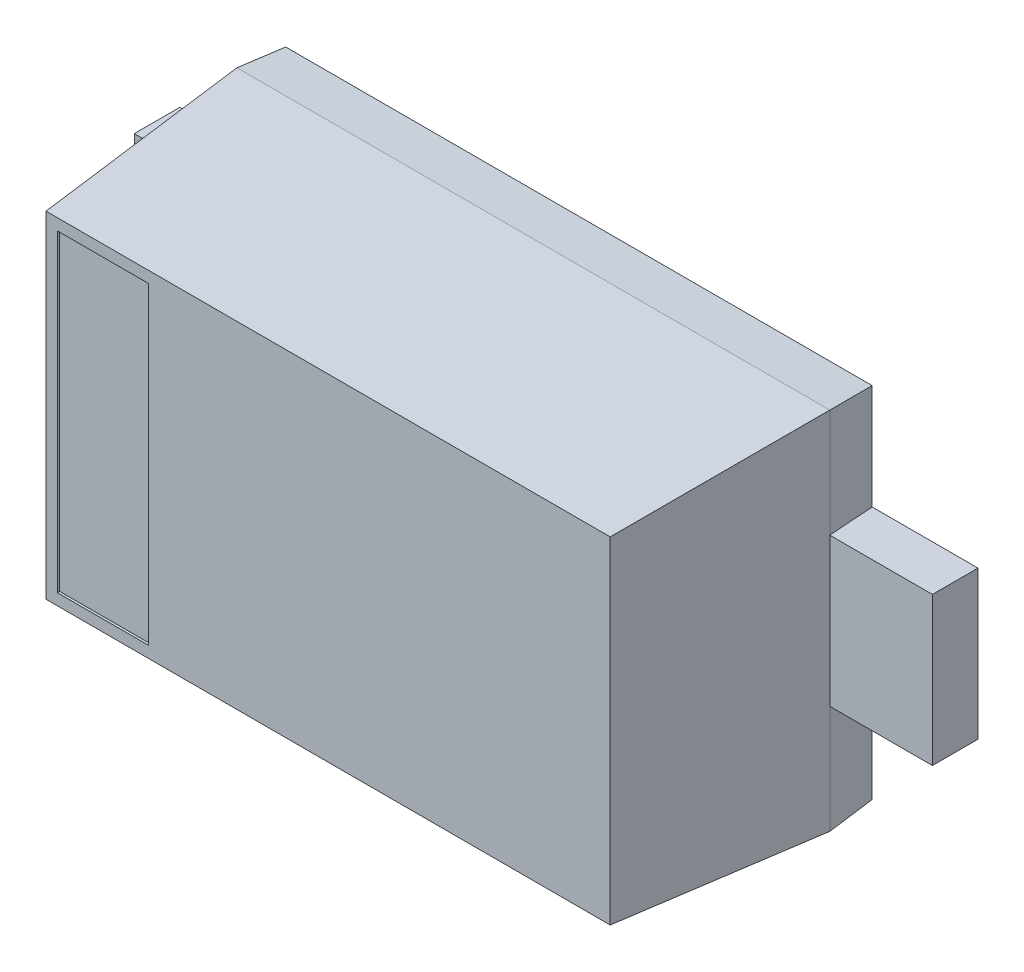
ISO-10303-21;
HEADER;
FILE_DESCRIPTION(('STEP AP214'),'2;1');
FILE_NAME('part.step','',(''),(''),'','','');
FILE_SCHEMA(('AUTOMOTIVE_DESIGN { 1 0 10303 214 1 1 1 1 }'));
ENDSEC;
DATA;
#1=APPLICATION_CONTEXT('core data for automotive mechanical design processes');
#2=APPLICATION_PROTOCOL_DEFINITION('international standard','automotive_design',2000,#1);
#3=PRODUCT_CONTEXT('',#1,'mechanical');
#4=PRODUCT('Part','Part','',(#3));
#5=PRODUCT_RELATED_PRODUCT_CATEGORY('part','',(#4));
#6=PRODUCT_DEFINITION_FORMATION('','',#4);
#7=PRODUCT_DEFINITION_CONTEXT('part definition',#1,'design');
#8=PRODUCT_DEFINITION('design','',#6,#7);
#9=PRODUCT_DEFINITION_SHAPE('','',#8);
#10=(LENGTH_UNIT() NAMED_UNIT(*) SI_UNIT(.MILLI.,.METRE.));
#11=(NAMED_UNIT(*) PLANE_ANGLE_UNIT() SI_UNIT($,.RADIAN.));
#12=(NAMED_UNIT(*) SI_UNIT($,.STERADIAN.) SOLID_ANGLE_UNIT());
#13=UNCERTAINTY_MEASURE_WITH_UNIT(LENGTH_MEASURE(1.E-05),#10,'distance_accuracy_value','');
#14=(GEOMETRIC_REPRESENTATION_CONTEXT(3) GLOBAL_UNCERTAINTY_ASSIGNED_CONTEXT((#13)) GLOBAL_UNIT_ASSIGNED_CONTEXT((#10,
#11,#12)) REPRESENTATION_CONTEXT('',''));
#15=CARTESIAN_POINT('',(0.,0.,0.));
#16=DIRECTION('',(0.,0.,1.));
#17=DIRECTION('',(1.,0.,0.));
#18=AXIS2_PLACEMENT_3D('',#15,#16,#17);
#19=CARTESIAN_POINT('',(-1.187065869251,-0.687065869251,1.09));
#20=DIRECTION('',(0.,0.,1.));
#21=DIRECTION('',(1.,0.,0.));
#22=AXIS2_PLACEMENT_3D('',#19,#20,#21);
#23=PLANE('',#22);
#24=DIRECTION('',(0.,1.,0.));
#25=VECTOR('',#24,1.);
#26=CARTESIAN_POINT('',(-1.187065869251,-0.687065869251,1.09));
#27=LINE('',#26,#25);
#28=CARTESIAN_POINT('',(-1.187065869251,-0.687065869251,1.09));
#29=VERTEX_POINT('',#28);
#30=CARTESIAN_POINT('',(-1.187065869251,0.687065869251,1.09));
#31=VERTEX_POINT('',#30);
#32=EDGE_CURVE('E307',#29,#31,#27,.T.);
#33=ORIENTED_EDGE('',*,*,#32,.F.);
#34=DIRECTION('',(1.,0.,0.));
#35=VECTOR('',#34,1.);
#36=CARTESIAN_POINT('',(-1.187065869251,-0.687065869251,1.09));
#37=LINE('',#36,#35);
#38=CARTESIAN_POINT('',(-0.787065869251,-0.687065869251,1.09));
#39=VERTEX_POINT('',#38);
#40=EDGE_CURVE('E308',#29,#39,#37,.T.);
#41=ORIENTED_EDGE('',*,*,#40,.T.);
#42=DIRECTION('',(0.,1.,0.));
#43=VECTOR('',#42,1.);
#44=CARTESIAN_POINT('',(-0.787065869251,-0.687065869251,1.09));
#45=LINE('',#44,#43);
#46=CARTESIAN_POINT('',(-0.787065869251,0.687065869251,1.09));
#47=VERTEX_POINT('',#46);
#48=EDGE_CURVE('E383',#39,#47,#45,.T.);
#49=ORIENTED_EDGE('',*,*,#48,.T.);
#50=DIRECTION('',(1.,0.,0.));
#51=VECTOR('',#50,1.);
#52=CARTESIAN_POINT('',(-1.187065869251,0.687065869251,1.09));
#53=LINE('',#52,#51);
#54=EDGE_CURVE('E215',#31,#47,#53,.T.);
#55=ORIENTED_EDGE('',*,*,#54,.F.);
#56=EDGE_LOOP('',(#33,#41,#49,#55));
#57=FACE_BOUND('',#56,.T.);
#58=ADVANCED_FACE('F17',(#57),#23,.T.);
#59=CARTESIAN_POINT('',(-1.286014637611,0.325,0.2));
#60=DIRECTION('',(0.,0.,1.));
#61=DIRECTION('',(1.,0.,0.));
#62=AXIS2_PLACEMENT_3D('',#59,#60,#61);
#63=PLANE('',#62);
#64=DIRECTION('',(0.,-1.,0.));
#65=VECTOR('',#64,1.);
#66=CARTESIAN_POINT('',(-1.3,0.8,0.2));
#67=LINE('',#66,#65);
#68=CARTESIAN_POINT('',(-1.3,0.325,0.2));
#69=VERTEX_POINT('',#68);
#70=CARTESIAN_POINT('',(-1.3,-0.325,0.2));
#71=VERTEX_POINT('',#70);
#72=EDGE_CURVE('E384',#69,#71,#67,.T.);
#73=ORIENTED_EDGE('',*,*,#72,.F.);
#74=DIRECTION('',(-1.,0.,0.));
#75=VECTOR('',#74,1.);
#76=CARTESIAN_POINT('',(-1.286014637611,0.325,0.2));
#77=LINE('',#76,#75);
#78=CARTESIAN_POINT('',(-1.75,0.325,0.2));
#79=VERTEX_POINT('',#78);
#80=EDGE_CURVE('E25',#69,#79,#77,.T.);
#81=ORIENTED_EDGE('',*,*,#80,.T.);
#82=DIRECTION('',(0.,-1.,0.));
#83=VECTOR('',#82,1.);
#84=CARTESIAN_POINT('',(-1.75,0.325,0.2));
#85=LINE('',#84,#83);
#86=CARTESIAN_POINT('',(-1.75,-0.325,0.2));
#87=VERTEX_POINT('',#86);
#88=EDGE_CURVE('E11',#79,#87,#85,.T.);
#89=ORIENTED_EDGE('',*,*,#88,.T.);
#90=DIRECTION('',(-1.,0.,0.));
#91=VECTOR('',#90,1.);
#92=CARTESIAN_POINT('',(-1.286014637611,-0.325,0.2));
#93=LINE('',#92,#91);
#94=EDGE_CURVE('E255',#71,#87,#93,.T.);
#95=ORIENTED_EDGE('',*,*,#94,.F.);
#96=EDGE_LOOP('',(#73,#81,#89,#95));
#97=FACE_BOUND('',#96,.T.);
#98=ADVANCED_FACE('F466',(#97),#63,.T.);
#99=CARTESIAN_POINT('',(-1.75,0.325,0.));
#100=DIRECTION('',(-1.,0.,0.));
#101=DIRECTION('',(0.,0.,1.));
#102=AXIS2_PLACEMENT_3D('',#99,#100,#101);
#103=PLANE('',#102);
#104=DIRECTION('',(0.,0.,1.));
#105=VECTOR('',#104,1.);
#106=CARTESIAN_POINT('',(-1.75,0.325,0.));
#107=LINE('',#106,#105);
#108=CARTESIAN_POINT('',(-1.75,0.325,0.));
#109=VERTEX_POINT('',#108);
#110=EDGE_CURVE('E460',#109,#79,#107,.T.);
#111=ORIENTED_EDGE('',*,*,#110,.F.);
#112=DIRECTION('',(0.,-1.,0.));
#113=VECTOR('',#112,1.);
#114=CARTESIAN_POINT('',(-1.75,0.325,0.));
#115=LINE('',#114,#113);
#116=CARTESIAN_POINT('',(-1.75,-0.325,0.));
#117=VERTEX_POINT('',#116);
#118=EDGE_CURVE('E437',#109,#117,#115,.T.);
#119=ORIENTED_EDGE('',*,*,#118,.T.);
#120=DIRECTION('',(0.,0.,1.));
#121=VECTOR('',#120,1.);
#122=CARTESIAN_POINT('',(-1.75,-0.325,0.));
#123=LINE('',#122,#121);
#124=EDGE_CURVE('E259',#117,#87,#123,.T.);
#125=ORIENTED_EDGE('',*,*,#124,.T.);
#126=ORIENTED_EDGE('',*,*,#88,.F.);
#127=EDGE_LOOP('',(#111,#119,#125,#126));
#128=FACE_BOUND('',#127,.T.);
#129=ADVANCED_FACE('F471',(#128),#103,.T.);
#130=CARTESIAN_POINT('',(-1.286014637611,0.325,0.));
#131=DIRECTION('',(0.,-1.,0.));
#132=DIRECTION('',(-1.,0.,0.));
#133=AXIS2_PLACEMENT_3D('',#130,#131,#132);
#134=PLANE('',#133);
#135=ORIENTED_EDGE('',*,*,#110,.T.);
#136=ORIENTED_EDGE('',*,*,#80,.F.);
#137=CARTESIAN_POINT('',(-1.286014637611,0.325,0.));
#138=CARTESIAN_POINT('',(-1.289510976465,0.325,0.04999997507219));
#139=CARTESIAN_POINT('',(-1.293007316516,0.325,0.09999996725694));
#140=CARTESIAN_POINT('',(-1.29650365771,0.325,0.149999975794));
#141=CARTESIAN_POINT('',(-1.3,0.325,0.2));
#142=(BOUNDED_CURVE() B_SPLINE_CURVE(4,(#137,#138,#139,#140,#141),.UNSPECIFIED.,.F.,
.F.) B_SPLINE_CURVE_WITH_KNOTS((5,5),(0.,1.),
.UNSPECIFIED.) CURVE() GEOMETRIC_REPRESENTATION_ITEM() RATIONAL_B_SPLINE_CURVE((1.,1.,1.,1.,1.)) REPRESENTATION_ITEM(''));
#143=CARTESIAN_POINT('',(-1.286014637611,0.325,0.));
#144=VERTEX_POINT('',#143);
#145=EDGE_CURVE('E367',#144,#69,#142,.T.);
#146=ORIENTED_EDGE('',*,*,#145,.F.);
#147=DIRECTION('',(-1.,0.,0.));
#148=VECTOR('',#147,1.);
#149=CARTESIAN_POINT('',(-1.286014637611,0.325,0.));
#150=LINE('',#149,#148);
#151=EDGE_CURVE('E374',#144,#109,#150,.T.);
#152=ORIENTED_EDGE('',*,*,#151,.T.);
#153=EDGE_LOOP('',(#135,#136,#146,#152));
#154=FACE_BOUND('',#153,.T.);
#155=ADVANCED_FACE('F468',(#154),#134,.F.);
#156=CARTESIAN_POINT('',(-1.286014637611,-0.325,0.));
#157=DIRECTION('',(0.,-1.,0.));
#158=DIRECTION('',(-1.,0.,0.));
#159=AXIS2_PLACEMENT_3D('',#156,#157,#158);
#160=PLANE('',#159);
#161=DIRECTION('',(-1.,0.,0.));
#162=VECTOR('',#161,1.);
#163=CARTESIAN_POINT('',(-1.286014637611,-0.325,0.));
#164=LINE('',#163,#162);
#165=CARTESIAN_POINT('',(-1.286014637611,-0.325,0.));
#166=VERTEX_POINT('',#165);
#167=EDGE_CURVE('E433',#166,#117,#164,.T.);
#168=ORIENTED_EDGE('',*,*,#167,.F.);
#169=CARTESIAN_POINT('',(-1.286014637611,-0.325,0.));
#170=CARTESIAN_POINT('',(-1.289510976465,-0.325,0.04999997507219));
#171=CARTESIAN_POINT('',(-1.293007316516,-0.325,0.09999996725694));
#172=CARTESIAN_POINT('',(-1.29650365771,-0.325,0.149999975794));
#173=CARTESIAN_POINT('',(-1.3,-0.325,0.2));
#174=(BOUNDED_CURVE() B_SPLINE_CURVE(4,(#169,#170,#171,#172,#173),.UNSPECIFIED.,.F.,
.F.) B_SPLINE_CURVE_WITH_KNOTS((5,5),(0.,1.),
.UNSPECIFIED.) CURVE() GEOMETRIC_REPRESENTATION_ITEM() RATIONAL_B_SPLINE_CURVE((1.,1.,1.,1.,1.)) REPRESENTATION_ITEM(''));
#175=EDGE_CURVE('E233',#166,#71,#174,.T.);
#176=ORIENTED_EDGE('',*,*,#175,.T.);
#177=ORIENTED_EDGE('',*,*,#94,.T.);
#178=ORIENTED_EDGE('',*,*,#124,.F.);
#179=EDGE_LOOP('',(#168,#176,#177,#178));
#180=FACE_BOUND('',#179,.T.);
#181=ADVANCED_FACE('F478',(#180),#160,.T.);
#182=CARTESIAN_POINT('',(-1.187065869251,0.687065869251,1.09));
#183=DIRECTION('',(0.,1.,0.));
#184=DIRECTION('',(1.,0.,0.));
#185=AXIS2_PLACEMENT_3D('',#182,#183,#184);
#186=PLANE('',#185);
#187=DIRECTION('',(1.,0.,0.));
#188=VECTOR('',#187,1.);
#189=CARTESIAN_POINT('',(-1.212065869251,0.687065869251,1.1));
#190=LINE('',#189,#188);
#191=CARTESIAN_POINT('',(-1.187065869251,0.687065869251,1.1));
#192=VERTEX_POINT('',#191);
#193=CARTESIAN_POINT('',(-0.787065869251,0.687065869251,1.1));
#194=VERTEX_POINT('',#193);
#195=EDGE_CURVE('E414',#192,#194,#190,.T.);
#196=ORIENTED_EDGE('',*,*,#195,.F.);
#197=DIRECTION('',(0.,0.,1.));
#198=VECTOR('',#197,1.);
#199=CARTESIAN_POINT('',(-1.187065869251,0.687065869251,1.09));
#200=LINE('',#199,#198);
#201=EDGE_CURVE('E453',#31,#192,#200,.T.);
#202=ORIENTED_EDGE('',*,*,#201,.F.);
#203=ORIENTED_EDGE('',*,*,#54,.T.);
#204=DIRECTION('',(0.,0.,1.));
#205=VECTOR('',#204,1.);
#206=CARTESIAN_POINT('',(-0.787065869251,0.687065869251,1.09));
#207=LINE('',#206,#205);
#208=EDGE_CURVE('E380',#47,#194,#207,.T.);
#209=ORIENTED_EDGE('',*,*,#208,.T.);
#210=EDGE_LOOP('',(#196,#202,#203,#209));
#211=FACE_BOUND('',#210,.T.);
#212=ADVANCED_FACE('F547',(#211),#186,.F.);
#213=CARTESIAN_POINT('',(-1.187065869251,-0.687065869251,1.09));
#214=DIRECTION('',(1.,0.,0.));
#215=DIRECTION('',(0.,1.,0.));
#216=AXIS2_PLACEMENT_3D('',#213,#214,#215);
#217=PLANE('',#216);
#218=DIRECTION('',(0.,0.,1.));
#219=VECTOR('',#218,1.);
#220=CARTESIAN_POINT('',(-1.187065869251,-0.687065869251,1.09));
#221=LINE('',#220,#219);
#222=CARTESIAN_POINT('',(-1.187065869251,-0.687065869251,1.1));
#223=VERTEX_POINT('',#222);
#224=EDGE_CURVE('E301',#29,#223,#221,.T.);
#225=ORIENTED_EDGE('',*,*,#224,.F.);
#226=ORIENTED_EDGE('',*,*,#32,.T.);
#227=ORIENTED_EDGE('',*,*,#201,.T.);
#228=DIRECTION('',(0.,-1.,0.));
#229=VECTOR('',#228,1.);
#230=CARTESIAN_POINT('',(-1.187065869251,-0.712065869251,1.1));
#231=LINE('',#230,#229);
#232=EDGE_CURVE('E410',#192,#223,#231,.T.);
#233=ORIENTED_EDGE('',*,*,#232,.T.);
#234=EDGE_LOOP('',(#225,#226,#227,#233));
#235=FACE_BOUND('',#234,.T.);
#236=ADVANCED_FACE('F536',(#235),#217,.T.);
#237=CARTESIAN_POINT('',(-1.187065869251,-0.687065869251,1.09));
#238=DIRECTION('',(0.,1.,0.));
#239=DIRECTION('',(1.,0.,0.));
#240=AXIS2_PLACEMENT_3D('',#237,#238,#239);
#241=PLANE('',#240);
#242=DIRECTION('',(0.,0.,1.));
#243=VECTOR('',#242,1.);
#244=CARTESIAN_POINT('',(-0.787065869251,-0.687065869251,1.09));
#245=LINE('',#244,#243);
#246=CARTESIAN_POINT('',(-0.787065869251,-0.687065869251,1.1));
#247=VERTEX_POINT('',#246);
#248=EDGE_CURVE('E399',#39,#247,#245,.T.);
#249=ORIENTED_EDGE('',*,*,#248,.F.);
#250=ORIENTED_EDGE('',*,*,#40,.F.);
#251=ORIENTED_EDGE('',*,*,#224,.T.);
#252=DIRECTION('',(1.,0.,0.));
#253=VECTOR('',#252,1.);
#254=CARTESIAN_POINT('',(-1.212065869251,-0.687065869251,1.1));
#255=LINE('',#254,#253);
#256=EDGE_CURVE('E406',#223,#247,#255,.T.);
#257=ORIENTED_EDGE('',*,*,#256,.T.);
#258=EDGE_LOOP('',(#249,#250,#251,#257));
#259=FACE_BOUND('',#258,.T.);
#260=ADVANCED_FACE('F540',(#259),#241,.T.);
#261=CARTESIAN_POINT('',(-0.787065869251,-0.687065869251,1.09));
#262=DIRECTION('',(1.,0.,0.));
#263=DIRECTION('',(0.,1.,0.));
#264=AXIS2_PLACEMENT_3D('',#261,#262,#263);
#265=PLANE('',#264);
#266=DIRECTION('',(0.,-1.,0.));
#267=VECTOR('',#266,1.);
#268=CARTESIAN_POINT('',(-0.787065869251,-0.712065869251,1.1));
#269=LINE('',#268,#267);
#270=EDGE_CURVE('E220',#194,#247,#269,.T.);
#271=ORIENTED_EDGE('',*,*,#270,.F.);
#272=ORIENTED_EDGE('',*,*,#208,.F.);
#273=ORIENTED_EDGE('',*,*,#48,.F.);
#274=ORIENTED_EDGE('',*,*,#248,.T.);
#275=EDGE_LOOP('',(#271,#272,#273,#274));
#276=FACE_BOUND('',#275,.T.);
#277=ADVANCED_FACE('F520',(#276),#265,.F.);
#278=CARTESIAN_POINT('',(-1.3,0.8,0.2));
#279=CARTESIAN_POINT('',(-1.237065869251,0.737065869251,1.1));
#280=CARTESIAN_POINT('',(-1.3,-0.8,0.2));
#281=CARTESIAN_POINT('',(-1.237065869251,-0.737065869251,1.1));
#282=(BOUNDED_SURFACE() B_SPLINE_SURFACE(1,1,((#278,#279),(#280,#281)),.UNSPECIFIED.,.F.,.F.,
.F.) B_SPLINE_SURFACE_WITH_KNOTS((2,2),(2,2),(0.,1.6),(0.,1.),
.UNSPECIFIED.) GEOMETRIC_REPRESENTATION_ITEM() RATIONAL_B_SPLINE_SURFACE(((1.,1.),(1.,1.))) REPRESENTATION_ITEM('') SURFACE());
#283=DIRECTION('',(0.,-1.,0.));
#284=VECTOR('',#283,1.);
#285=CARTESIAN_POINT('',(-1.3,0.8,0.2));
#286=LINE('',#285,#284);
#287=CARTESIAN_POINT('',(-1.3,0.8,0.2));
#288=VERTEX_POINT('',#287);
#289=EDGE_CURVE('E373',#288,#69,#286,.T.);
#290=DIRECTION('',(0.,-1.,0.));
#291=VECTOR('',#290,1.);
#292=CARTESIAN_POINT('',(-1.3,0.8,0.2));
#293=LINE('',#292,#291);
#294=CARTESIAN_POINT('',(-1.3,-0.8,0.2));
#295=VERTEX_POINT('',#294);
#296=EDGE_CURVE('E355',#71,#295,#293,.T.);
#297=CARTESIAN_POINT('',(-1.3,-0.8,0.2));
#298=CARTESIAN_POINT('',(-1.237065869251,-0.737065869251,1.1));
#299=(BOUNDED_CURVE() B_SPLINE_CURVE(1,(#297,#298),.UNSPECIFIED.,.F.,
.F.) B_SPLINE_CURVE_WITH_KNOTS((2,2),(0.,1.),
.UNSPECIFIED.) CURVE() GEOMETRIC_REPRESENTATION_ITEM() RATIONAL_B_SPLINE_CURVE((1.,1.)) REPRESENTATION_ITEM(''));
#300=CARTESIAN_POINT('',(-1.237065869251,-0.737065869251,1.1));
#301=VERTEX_POINT('',#300);
#302=EDGE_CURVE('E387',#295,#301,#299,.T.);
#303=DIRECTION('',(0.,-1.,0.));
#304=VECTOR('',#303,1.);
#305=CARTESIAN_POINT('',(-1.237065869251,0.737065869251,1.1));
#306=LINE('',#305,#304);
#307=CARTESIAN_POINT('',(-1.237065869251,0.737065869251,1.1));
#308=VERTEX_POINT('',#307);
#309=EDGE_CURVE('E403',#308,#301,#306,.T.);
#310=CARTESIAN_POINT('',(-1.3,0.8,0.2));
#311=CARTESIAN_POINT('',(-1.237065869251,0.737065869251,1.1));
#312=(BOUNDED_CURVE() B_SPLINE_CURVE(1,(#310,#311),.UNSPECIFIED.,.F.,
.F.) B_SPLINE_CURVE_WITH_KNOTS((2,2),(0.,1.),
.UNSPECIFIED.) CURVE() GEOMETRIC_REPRESENTATION_ITEM() RATIONAL_B_SPLINE_CURVE((1.,1.)) REPRESENTATION_ITEM(''));
#313=EDGE_CURVE('E219',#288,#308,#312,.T.);
#314=ORIENTED_EDGE('',*,*,#289,.T.);
#315=ORIENTED_EDGE('',*,*,#72,.T.);
#316=ORIENTED_EDGE('',*,*,#296,.T.);
#317=ORIENTED_EDGE('',*,*,#302,.T.);
#318=ORIENTED_EDGE('',*,*,#309,.F.);
#319=ORIENTED_EDGE('',*,*,#313,.F.);
#320=EDGE_LOOP('',(#314,#315,#316,#317,#318,#319));
#321=FACE_BOUND('',#320,.T.);
#322=ADVANCED_FACE('F486',(#321),#282,.T.);
#323=CARTESIAN_POINT('',(-1.286014637611,0.786014637611,0.));
#324=CARTESIAN_POINT('',(-1.3,0.8,0.2));
#325=CARTESIAN_POINT('',(-1.286014637611,-0.786014637611,0.));
#326=CARTESIAN_POINT('',(-1.3,-0.8,0.2));
#327=(BOUNDED_SURFACE() B_SPLINE_SURFACE(1,1,((#323,#324),(#325,#326)),.UNSPECIFIED.,.F.,.F.,
.F.) B_SPLINE_SURFACE_WITH_KNOTS((2,2),(2,2),(0.,1.6),(0.,1.),
.UNSPECIFIED.) GEOMETRIC_REPRESENTATION_ITEM() RATIONAL_B_SPLINE_SURFACE(((1.,1.),(1.,1.))) REPRESENTATION_ITEM('') SURFACE());
#328=CARTESIAN_POINT('',(-1.286014637611,0.786014637611,0.));
#329=CARTESIAN_POINT('',(-1.3,0.8,0.2));
#330=(BOUNDED_CURVE() B_SPLINE_CURVE(1,(#328,#329),.UNSPECIFIED.,.F.,
.F.) B_SPLINE_CURVE_WITH_KNOTS((2,2),(0.,1.),
.UNSPECIFIED.) CURVE() GEOMETRIC_REPRESENTATION_ITEM() RATIONAL_B_SPLINE_CURVE((1.,1.)) REPRESENTATION_ITEM(''));
#331=CARTESIAN_POINT('',(-1.286014637611,0.786014637611,0.));
#332=VERTEX_POINT('',#331);
#333=EDGE_CURVE('E227',#332,#288,#330,.T.);
#334=DIRECTION('',(0.,-1.,0.));
#335=VECTOR('',#334,1.);
#336=CARTESIAN_POINT('',(-1.286014637611,0.786014637611,0.));
#337=LINE('',#336,#335);
#338=EDGE_CURVE('E287',#332,#144,#337,.T.);
#339=ORIENTED_EDGE('',*,*,#333,.F.);
#340=ORIENTED_EDGE('',*,*,#338,.T.);
#341=ORIENTED_EDGE('',*,*,#145,.T.);
#342=ORIENTED_EDGE('',*,*,#289,.F.);
#343=EDGE_LOOP('',(#339,#340,#341,#342));
#344=FACE_BOUND('',#343,.T.);
#345=ADVANCED_FACE('F511',(#344),#327,.T.);
#346=CARTESIAN_POINT('',(-1.286014637611,0.325,0.));
#347=DIRECTION('',(0.,0.,1.));
#348=DIRECTION('',(1.,0.,0.));
#349=AXIS2_PLACEMENT_3D('',#346,#347,#348);
#350=PLANE('',#349);
#351=ORIENTED_EDGE('',*,*,#167,.T.);
#352=ORIENTED_EDGE('',*,*,#118,.F.);
#353=ORIENTED_EDGE('',*,*,#151,.F.);
#354=DIRECTION('',(0.,-1.,0.));
#355=VECTOR('',#354,1.);
#356=CARTESIAN_POINT('',(-1.286014637611,0.325,0.));
#357=LINE('',#356,#355);
#358=EDGE_CURVE('E292',#144,#166,#357,.T.);
#359=ORIENTED_EDGE('',*,*,#358,.T.);
#360=EDGE_LOOP('',(#351,#352,#353,#359));
#361=FACE_BOUND('',#360,.T.);
#362=ADVANCED_FACE('F473',(#361),#350,.F.);
#363=CARTESIAN_POINT('',(-1.286014637611,0.786014637611,0.));
#364=CARTESIAN_POINT('',(-1.3,0.8,0.2));
#365=CARTESIAN_POINT('',(-1.286014637611,-0.786014637611,0.));
#366=CARTESIAN_POINT('',(-1.3,-0.8,0.2));
#367=(BOUNDED_SURFACE() B_SPLINE_SURFACE(1,1,((#363,#364),(#365,#366)),.UNSPECIFIED.,.F.,.F.,
.F.) B_SPLINE_SURFACE_WITH_KNOTS((2,2),(2,2),(0.,1.6),(0.,1.),
.UNSPECIFIED.) GEOMETRIC_REPRESENTATION_ITEM() RATIONAL_B_SPLINE_SURFACE(((1.,1.),(1.,1.))) REPRESENTATION_ITEM('') SURFACE());
#368=DIRECTION('',(0.,-1.,0.));
#369=VECTOR('',#368,1.);
#370=CARTESIAN_POINT('',(-1.286014637611,0.786014637611,0.));
#371=LINE('',#370,#369);
#372=CARTESIAN_POINT('',(-1.286014637611,-0.786014637611,0.));
#373=VERTEX_POINT('',#372);
#374=EDGE_CURVE('E312',#166,#373,#371,.T.);
#375=CARTESIAN_POINT('',(-1.286014637611,-0.786014637611,0.));
#376=CARTESIAN_POINT('',(-1.3,-0.8,0.2));
#377=(BOUNDED_CURVE() B_SPLINE_CURVE(1,(#375,#376),.UNSPECIFIED.,.F.,
.F.) B_SPLINE_CURVE_WITH_KNOTS((2,2),(0.,1.),
.UNSPECIFIED.) CURVE() GEOMETRIC_REPRESENTATION_ITEM() RATIONAL_B_SPLINE_CURVE((1.,1.)) REPRESENTATION_ITEM(''));
#378=EDGE_CURVE('E323',#373,#295,#377,.T.);
#379=ORIENTED_EDGE('',*,*,#175,.F.);
#380=ORIENTED_EDGE('',*,*,#374,.T.);
#381=ORIENTED_EDGE('',*,*,#378,.T.);
#382=ORIENTED_EDGE('',*,*,#296,.F.);
#383=EDGE_LOOP('',(#379,#380,#381,#382));
#384=FACE_BOUND('',#383,.T.);
#385=ADVANCED_FACE('F481',(#384),#367,.T.);
#386=CARTESIAN_POINT('',(1.286014637611,0.786014637611,0.));
#387=CARTESIAN_POINT('',(1.3,0.8,0.2));
#388=CARTESIAN_POINT('',(-1.286014637611,0.786014637611,0.));
#389=CARTESIAN_POINT('',(-1.3,0.8,0.2));
#390=(BOUNDED_SURFACE() B_SPLINE_SURFACE(1,1,((#386,#387),(#388,#389)),.UNSPECIFIED.,.F.,.F.,
.F.) B_SPLINE_SURFACE_WITH_KNOTS((2,2),(2,2),(0.,2.6),(0.,1.),
.UNSPECIFIED.) GEOMETRIC_REPRESENTATION_ITEM() RATIONAL_B_SPLINE_SURFACE(((1.,1.),(1.,1.))) REPRESENTATION_ITEM('') SURFACE());
#391=DIRECTION('',(-1.,0.,0.));
#392=VECTOR('',#391,1.);
#393=CARTESIAN_POINT('',(1.286014637611,0.786014637611,0.));
#394=LINE('',#393,#392);
#395=CARTESIAN_POINT('',(1.286014637611,0.786014637611,0.));
#396=VERTEX_POINT('',#395);
#397=EDGE_CURVE('E291',#396,#332,#394,.T.);
#398=DIRECTION('',(-1.,0.,0.));
#399=VECTOR('',#398,1.);
#400=CARTESIAN_POINT('',(1.3,0.8,0.2));
#401=LINE('',#400,#399);
#402=CARTESIAN_POINT('',(1.3,0.8,0.2));
#403=VERTEX_POINT('',#402);
#404=EDGE_CURVE('E217',#403,#288,#401,.T.);
#405=CARTESIAN_POINT('',(1.286014637611,0.786014637611,0.));
#406=CARTESIAN_POINT('',(1.3,0.8,0.2));
#407=(BOUNDED_CURVE() B_SPLINE_CURVE(1,(#405,#406),.UNSPECIFIED.,.F.,
.F.) B_SPLINE_CURVE_WITH_KNOTS((2,2),(0.,1.),
.UNSPECIFIED.) CURVE() GEOMETRIC_REPRESENTATION_ITEM() RATIONAL_B_SPLINE_CURVE((1.,1.)) REPRESENTATION_ITEM(''));
#408=EDGE_CURVE('E340',#396,#403,#407,.T.);
#409=ORIENTED_EDGE('',*,*,#397,.T.);
#410=ORIENTED_EDGE('',*,*,#333,.T.);
#411=ORIENTED_EDGE('',*,*,#404,.F.);
#412=ORIENTED_EDGE('',*,*,#408,.F.);
#413=EDGE_LOOP('',(#409,#410,#411,#412));
#414=FACE_BOUND('',#413,.T.);
#415=ADVANCED_FACE('F501',(#414),#390,.T.);
#416=CARTESIAN_POINT('',(1.3,0.8,0.2));
#417=CARTESIAN_POINT('',(1.237065869251,0.737065869251,1.1));
#418=CARTESIAN_POINT('',(-1.3,0.8,0.2));
#419=CARTESIAN_POINT('',(-1.237065869251,0.737065869251,1.1));
#420=(BOUNDED_SURFACE() B_SPLINE_SURFACE(1,1,((#416,#417),(#418,#419)),.UNSPECIFIED.,.F.,.F.,
.F.) B_SPLINE_SURFACE_WITH_KNOTS((2,2),(2,2),(0.,2.6),(0.,1.),
.UNSPECIFIED.) GEOMETRIC_REPRESENTATION_ITEM() RATIONAL_B_SPLINE_SURFACE(((1.,1.),(1.,1.))) REPRESENTATION_ITEM('') SURFACE());
#421=DIRECTION('',(-1.,0.,0.));
#422=VECTOR('',#421,1.);
#423=CARTESIAN_POINT('',(1.237065869251,0.737065869251,1.1));
#424=LINE('',#423,#422);
#425=CARTESIAN_POINT('',(1.237065869251,0.737065869251,1.1));
#426=VERTEX_POINT('',#425);
#427=EDGE_CURVE('E393',#426,#308,#424,.T.);
#428=CARTESIAN_POINT('',(1.3,0.8,0.2));
#429=CARTESIAN_POINT('',(1.237065869251,0.737065869251,1.1));
#430=(BOUNDED_CURVE() B_SPLINE_CURVE(1,(#428,#429),.UNSPECIFIED.,.F.,
.F.) B_SPLINE_CURVE_WITH_KNOTS((2,2),(0.,1.),
.UNSPECIFIED.) CURVE() GEOMETRIC_REPRESENTATION_ITEM() RATIONAL_B_SPLINE_CURVE((1.,1.)) REPRESENTATION_ITEM(''));
#431=EDGE_CURVE('E253',#403,#426,#430,.T.);
#432=ORIENTED_EDGE('',*,*,#404,.T.);
#433=ORIENTED_EDGE('',*,*,#313,.T.);
#434=ORIENTED_EDGE('',*,*,#427,.F.);
#435=ORIENTED_EDGE('',*,*,#431,.F.);
#436=EDGE_LOOP('',(#432,#433,#434,#435));
#437=FACE_BOUND('',#436,.T.);
#438=ADVANCED_FACE('F498',(#437),#420,.T.);
#439=CARTESIAN_POINT('',(-1.237065869251,-0.737065869251,1.1));
#440=DIRECTION('',(0.,0.,-1.));
#441=DIRECTION('',(0.,-1.,0.));
#442=AXIS2_PLACEMENT_3D('',#439,#440,#441);
#443=PLANE('',#442);
#444=ORIENTED_EDGE('',*,*,#256,.F.);
#445=ORIENTED_EDGE('',*,*,#232,.F.);
#446=ORIENTED_EDGE('',*,*,#195,.T.);
#447=ORIENTED_EDGE('',*,*,#270,.T.);
#448=EDGE_LOOP('',(#444,#445,#446,#447));
#449=FACE_BOUND('',#448,.T.);
#450=DIRECTION('',(0.,1.,0.));
#451=VECTOR('',#450,1.);
#452=CARTESIAN_POINT('',(1.237065869251,-0.737065869251,1.1));
#453=LINE('',#452,#451);
#454=CARTESIAN_POINT('',(1.237065869251,-0.737065869251,1.1));
#455=VERTEX_POINT('',#454);
#456=EDGE_CURVE('E300',#455,#426,#453,.T.);
#457=ORIENTED_EDGE('',*,*,#456,.T.);
#458=ORIENTED_EDGE('',*,*,#427,.T.);
#459=ORIENTED_EDGE('',*,*,#309,.T.);
#460=DIRECTION('',(1.,0.,0.));
#461=VECTOR('',#460,1.);
#462=CARTESIAN_POINT('',(-1.237065869251,-0.737065869251,1.1));
#463=LINE('',#462,#461);
#464=EDGE_CURVE('E332',#301,#455,#463,.T.);
#465=ORIENTED_EDGE('',*,*,#464,.T.);
#466=EDGE_LOOP('',(#457,#458,#459,#465));
#467=FACE_BOUND('',#466,.T.);
#468=ADVANCED_FACE('F494',(#449,#467),#443,.F.);
#469=CARTESIAN_POINT('',(-1.3,-0.8,0.2));
#470=CARTESIAN_POINT('',(-1.237065869251,-0.737065869251,1.1));
#471=CARTESIAN_POINT('',(1.3,-0.8,0.2));
#472=CARTESIAN_POINT('',(1.237065869251,-0.737065869251,1.1));
#473=(BOUNDED_SURFACE() B_SPLINE_SURFACE(1,1,((#469,#470),(#471,#472)),.UNSPECIFIED.,.F.,.F.,
.F.) B_SPLINE_SURFACE_WITH_KNOTS((2,2),(2,2),(0.,2.6),(0.,1.),
.UNSPECIFIED.) GEOMETRIC_REPRESENTATION_ITEM() RATIONAL_B_SPLINE_SURFACE(((1.,1.),(1.,1.))) REPRESENTATION_ITEM('') SURFACE());
#474=DIRECTION('',(1.,0.,0.));
#475=VECTOR('',#474,1.);
#476=CARTESIAN_POINT('',(-1.3,-0.8,0.2));
#477=LINE('',#476,#475);
#478=CARTESIAN_POINT('',(1.3,-0.8,0.2));
#479=VERTEX_POINT('',#478);
#480=EDGE_CURVE('E333',#295,#479,#477,.T.);
#481=CARTESIAN_POINT('',(1.3,-0.8,0.2));
#482=CARTESIAN_POINT('',(1.237065869251,-0.737065869251,1.1));
#483=(BOUNDED_CURVE() B_SPLINE_CURVE(1,(#481,#482),.UNSPECIFIED.,.F.,
.F.) B_SPLINE_CURVE_WITH_KNOTS((2,2),(0.,1.),
.UNSPECIFIED.) CURVE() GEOMETRIC_REPRESENTATION_ITEM() RATIONAL_B_SPLINE_CURVE((1.,1.)) REPRESENTATION_ITEM(''));
#484=EDGE_CURVE('E316',#479,#455,#483,.T.);
#485=ORIENTED_EDGE('',*,*,#480,.T.);
#486=ORIENTED_EDGE('',*,*,#484,.T.);
#487=ORIENTED_EDGE('',*,*,#464,.F.);
#488=ORIENTED_EDGE('',*,*,#302,.F.);
#489=EDGE_LOOP('',(#485,#486,#487,#488));
#490=FACE_BOUND('',#489,.T.);
#491=ADVANCED_FACE('F490',(#490),#473,.T.);
#492=CARTESIAN_POINT('',(-1.286014637611,-0.786014637611,0.));
#493=CARTESIAN_POINT('',(-1.3,-0.8,0.2));
#494=CARTESIAN_POINT('',(1.286014637611,-0.786014637611,0.));
#495=CARTESIAN_POINT('',(1.3,-0.8,0.2));
#496=(BOUNDED_SURFACE() B_SPLINE_SURFACE(1,1,((#492,#493),(#494,#495)),.UNSPECIFIED.,.F.,.F.,
.F.) B_SPLINE_SURFACE_WITH_KNOTS((2,2),(2,2),(0.,2.6),(0.,1.),
.UNSPECIFIED.) GEOMETRIC_REPRESENTATION_ITEM() RATIONAL_B_SPLINE_SURFACE(((1.,1.),(1.,1.))) REPRESENTATION_ITEM('') SURFACE());
#497=DIRECTION('',(1.,0.,0.));
#498=VECTOR('',#497,1.);
#499=CARTESIAN_POINT('',(-1.286014637611,-0.786014637611,0.));
#500=LINE('',#499,#498);
#501=CARTESIAN_POINT('',(1.286014637611,-0.786014637611,0.));
#502=VERTEX_POINT('',#501);
#503=EDGE_CURVE('E346',#373,#502,#500,.T.);
#504=CARTESIAN_POINT('',(1.286014637611,-0.786014637611,0.));
#505=CARTESIAN_POINT('',(1.3,-0.8,0.2));
#506=(BOUNDED_CURVE() B_SPLINE_CURVE(1,(#504,#505),.UNSPECIFIED.,.F.,
.F.) B_SPLINE_CURVE_WITH_KNOTS((2,2),(0.,1.),
.UNSPECIFIED.) CURVE() GEOMETRIC_REPRESENTATION_ITEM() RATIONAL_B_SPLINE_CURVE((1.,1.)) REPRESENTATION_ITEM(''));
#507=EDGE_CURVE('E225',#502,#479,#506,.T.);
#508=ORIENTED_EDGE('',*,*,#503,.T.);
#509=ORIENTED_EDGE('',*,*,#507,.T.);
#510=ORIENTED_EDGE('',*,*,#480,.F.);
#511=ORIENTED_EDGE('',*,*,#378,.F.);
#512=EDGE_LOOP('',(#508,#509,#510,#511));
#513=FACE_BOUND('',#512,.T.);
#514=ADVANCED_FACE('F563',(#513),#496,.T.);
#515=CARTESIAN_POINT('',(-1.286014637611,-0.786014637611,0.));
#516=DIRECTION('',(0.,0.,-1.));
#517=DIRECTION('',(0.,-1.,0.));
#518=AXIS2_PLACEMENT_3D('',#515,#516,#517);
#519=PLANE('',#518);
#520=ORIENTED_EDGE('',*,*,#503,.F.);
#521=ORIENTED_EDGE('',*,*,#374,.F.);
#522=ORIENTED_EDGE('',*,*,#358,.F.);
#523=ORIENTED_EDGE('',*,*,#338,.F.);
#524=ORIENTED_EDGE('',*,*,#397,.F.);
#525=DIRECTION('',(0.,1.,0.));
#526=VECTOR('',#525,1.);
#527=CARTESIAN_POINT('',(1.286014637611,-0.786014637611,0.));
#528=LINE('',#527,#526);
#529=CARTESIAN_POINT('',(1.286014637611,0.325,0.));
#530=VERTEX_POINT('',#529);
#531=EDGE_CURVE('E322',#530,#396,#528,.T.);
#532=ORIENTED_EDGE('',*,*,#531,.F.);
#533=DIRECTION('',(0.,1.,0.));
#534=VECTOR('',#533,1.);
#535=CARTESIAN_POINT('',(1.286014637611,-0.325,0.));
#536=LINE('',#535,#534);
#537=CARTESIAN_POINT('',(1.286014637611,-0.325,0.));
#538=VERTEX_POINT('',#537);
#539=EDGE_CURVE('E222',#538,#530,#536,.T.);
#540=ORIENTED_EDGE('',*,*,#539,.F.);
#541=DIRECTION('',(0.,1.,0.));
#542=VECTOR('',#541,1.);
#543=CARTESIAN_POINT('',(1.286014637611,-0.786014637611,0.));
#544=LINE('',#543,#542);
#545=EDGE_CURVE('E281',#502,#538,#544,.T.);
#546=ORIENTED_EDGE('',*,*,#545,.F.);
#547=EDGE_LOOP('',(#520,#521,#522,#523,#524,#532,#540,#546));
#548=FACE_BOUND('',#547,.T.);
#549=ADVANCED_FACE('F507',(#548),#519,.T.);
#550=CARTESIAN_POINT('',(1.286014637611,-0.786014637611,0.));
#551=CARTESIAN_POINT('',(1.3,-0.8,0.2));
#552=CARTESIAN_POINT('',(1.286014637611,0.786014637611,0.));
#553=CARTESIAN_POINT('',(1.3,0.8,0.2));
#554=(BOUNDED_SURFACE() B_SPLINE_SURFACE(1,1,((#550,#551),(#552,#553)),.UNSPECIFIED.,.F.,.F.,
.F.) B_SPLINE_SURFACE_WITH_KNOTS((2,2),(2,2),(0.,1.6),(0.,1.),
.UNSPECIFIED.) GEOMETRIC_REPRESENTATION_ITEM() RATIONAL_B_SPLINE_SURFACE(((1.,1.),(1.,1.))) REPRESENTATION_ITEM('') SURFACE());
#555=CARTESIAN_POINT('',(1.286014637611,0.325,0.));
#556=CARTESIAN_POINT('',(1.289510976465,0.325,0.04999997507219));
#557=CARTESIAN_POINT('',(1.293007316516,0.325,0.09999996725694));
#558=CARTESIAN_POINT('',(1.29650365771,0.325,0.149999975794));
#559=CARTESIAN_POINT('',(1.3,0.325,0.2));
#560=(BOUNDED_CURVE() B_SPLINE_CURVE(4,(#555,#556,#557,#558,#559),.UNSPECIFIED.,.F.,
.F.) B_SPLINE_CURVE_WITH_KNOTS((5,5),(0.,1.),
.UNSPECIFIED.) CURVE() GEOMETRIC_REPRESENTATION_ITEM() RATIONAL_B_SPLINE_CURVE((1.,1.,1.,1.,1.)) REPRESENTATION_ITEM(''));
#561=CARTESIAN_POINT('',(1.3,0.325,0.2));
#562=VERTEX_POINT('',#561);
#563=EDGE_CURVE('E226',#530,#562,#560,.T.);
#564=DIRECTION('',(0.,1.,0.));
#565=VECTOR('',#564,1.);
#566=CARTESIAN_POINT('',(1.3,-0.8,0.2));
#567=LINE('',#566,#565);
#568=EDGE_CURVE('E249',#562,#403,#567,.T.);
#569=ORIENTED_EDGE('',*,*,#563,.F.);
#570=ORIENTED_EDGE('',*,*,#531,.T.);
#571=ORIENTED_EDGE('',*,*,#408,.T.);
#572=ORIENTED_EDGE('',*,*,#568,.F.);
#573=EDGE_LOOP('',(#569,#570,#571,#572));
#574=FACE_BOUND('',#573,.T.);
#575=ADVANCED_FACE('F504',(#574),#554,.T.);
#576=CARTESIAN_POINT('',(1.3,-0.8,0.2));
#577=CARTESIAN_POINT('',(1.237065869251,-0.737065869251,1.1));
#578=CARTESIAN_POINT('',(1.3,0.8,0.2));
#579=CARTESIAN_POINT('',(1.237065869251,0.737065869251,1.1));
#580=(BOUNDED_SURFACE() B_SPLINE_SURFACE(1,1,((#576,#577),(#578,#579)),.UNSPECIFIED.,.F.,.F.,
.F.) B_SPLINE_SURFACE_WITH_KNOTS((2,2),(2,2),(0.,1.6),(0.,1.),
.UNSPECIFIED.) GEOMETRIC_REPRESENTATION_ITEM() RATIONAL_B_SPLINE_SURFACE(((1.,1.),(1.,1.))) REPRESENTATION_ITEM('') SURFACE());
#581=DIRECTION('',(0.,1.,0.));
#582=VECTOR('',#581,1.);
#583=CARTESIAN_POINT('',(1.3,-0.8,0.2));
#584=LINE('',#583,#582);
#585=CARTESIAN_POINT('',(1.3,-0.325,0.2));
#586=VERTEX_POINT('',#585);
#587=EDGE_CURVE('E254',#479,#586,#584,.T.);
#588=DIRECTION('',(0.,1.,0.));
#589=VECTOR('',#588,1.);
#590=CARTESIAN_POINT('',(1.3,-0.8,0.2));
#591=LINE('',#590,#589);
#592=EDGE_CURVE('E191',#586,#562,#591,.T.);
#593=ORIENTED_EDGE('',*,*,#587,.T.);
#594=ORIENTED_EDGE('',*,*,#592,.T.);
#595=ORIENTED_EDGE('',*,*,#568,.T.);
#596=ORIENTED_EDGE('',*,*,#431,.T.);
#597=ORIENTED_EDGE('',*,*,#456,.F.);
#598=ORIENTED_EDGE('',*,*,#484,.F.);
#599=EDGE_LOOP('',(#593,#594,#595,#596,#597,#598));
#600=FACE_BOUND('',#599,.T.);
#601=ADVANCED_FACE('F670',(#600),#580,.T.);
#602=CARTESIAN_POINT('',(1.286014637611,-0.786014637611,0.));
#603=CARTESIAN_POINT('',(1.3,-0.8,0.2));
#604=CARTESIAN_POINT('',(1.286014637611,0.786014637611,0.));
#605=CARTESIAN_POINT('',(1.3,0.8,0.2));
#606=(BOUNDED_SURFACE() B_SPLINE_SURFACE(1,1,((#602,#603),(#604,#605)),.UNSPECIFIED.,.F.,.F.,
.F.) B_SPLINE_SURFACE_WITH_KNOTS((2,2),(2,2),(0.,1.6),(0.,1.),
.UNSPECIFIED.) GEOMETRIC_REPRESENTATION_ITEM() RATIONAL_B_SPLINE_SURFACE(((1.,1.),(1.,1.))) REPRESENTATION_ITEM('') SURFACE());
#607=CARTESIAN_POINT('',(1.286014637611,-0.325,0.));
#608=CARTESIAN_POINT('',(1.289510976465,-0.325,0.04999997507219));
#609=CARTESIAN_POINT('',(1.293007316516,-0.325,0.09999996725694));
#610=CARTESIAN_POINT('',(1.29650365771,-0.325,0.149999975794));
#611=CARTESIAN_POINT('',(1.3,-0.325,0.2));
#612=(BOUNDED_CURVE() B_SPLINE_CURVE(4,(#607,#608,#609,#610,#611),.UNSPECIFIED.,.F.,
.F.) B_SPLINE_CURVE_WITH_KNOTS((5,5),(0.,1.),
.UNSPECIFIED.) CURVE() GEOMETRIC_REPRESENTATION_ITEM() RATIONAL_B_SPLINE_CURVE((1.,1.,1.,1.,1.)) REPRESENTATION_ITEM(''));
#613=EDGE_CURVE('E187',#538,#586,#612,.T.);
#614=ORIENTED_EDGE('',*,*,#507,.F.);
#615=ORIENTED_EDGE('',*,*,#545,.T.);
#616=ORIENTED_EDGE('',*,*,#613,.T.);
#617=ORIENTED_EDGE('',*,*,#587,.F.);
#618=EDGE_LOOP('',(#614,#615,#616,#617));
#619=FACE_BOUND('',#618,.T.);
#620=ADVANCED_FACE('F561',(#619),#606,.T.);
#621=CARTESIAN_POINT('',(1.286014637611,-0.325,0.));
#622=DIRECTION('',(0.,0.,1.));
#623=DIRECTION('',(1.,0.,0.));
#624=AXIS2_PLACEMENT_3D('',#621,#622,#623);
#625=PLANE('',#624);
#626=DIRECTION('',(1.,0.,0.));
#627=VECTOR('',#626,1.);
#628=CARTESIAN_POINT('',(1.286014637611,0.325,0.));
#629=LINE('',#628,#627);
#630=CARTESIAN_POINT('',(1.75,0.325,0.));
#631=VERTEX_POINT('',#630);
#632=EDGE_CURVE('E197',#530,#631,#629,.T.);
#633=ORIENTED_EDGE('',*,*,#632,.T.);
#634=DIRECTION('',(0.,1.,0.));
#635=VECTOR('',#634,1.);
#636=CARTESIAN_POINT('',(1.75,-0.325,0.));
#637=LINE('',#636,#635);
#638=CARTESIAN_POINT('',(1.75,-0.325,0.));
#639=VERTEX_POINT('',#638);
#640=EDGE_CURVE('E194',#639,#631,#637,.T.);
#641=ORIENTED_EDGE('',*,*,#640,.F.);
#642=DIRECTION('',(1.,0.,0.));
#643=VECTOR('',#642,1.);
#644=CARTESIAN_POINT('',(1.286014637611,-0.325,0.));
#645=LINE('',#644,#643);
#646=EDGE_CURVE('E180',#538,#639,#645,.T.);
#647=ORIENTED_EDGE('',*,*,#646,.F.);
#648=ORIENTED_EDGE('',*,*,#539,.T.);
#649=EDGE_LOOP('',(#633,#641,#647,#648));
#650=FACE_BOUND('',#649,.T.);
#651=ADVANCED_FACE('F195',(#650),#625,.F.);
#652=CARTESIAN_POINT('',(1.286014637611,0.325,0.));
#653=DIRECTION('',(0.,1.,0.));
#654=DIRECTION('',(1.,0.,0.));
#655=AXIS2_PLACEMENT_3D('',#652,#653,#654);
#656=PLANE('',#655);
#657=ORIENTED_EDGE('',*,*,#632,.F.);
#658=ORIENTED_EDGE('',*,*,#563,.T.);
#659=DIRECTION('',(1.,0.,0.));
#660=VECTOR('',#659,1.);
#661=CARTESIAN_POINT('',(1.286014637611,0.325,0.2));
#662=LINE('',#661,#660);
#663=CARTESIAN_POINT('',(1.75,0.325,0.2));
#664=VERTEX_POINT('',#663);
#665=EDGE_CURVE('E263',#562,#664,#662,.T.);
#666=ORIENTED_EDGE('',*,*,#665,.T.);
#667=DIRECTION('',(0.,0.,1.));
#668=VECTOR('',#667,1.);
#669=CARTESIAN_POINT('',(1.75,0.325,0.));
#670=LINE('',#669,#668);
#671=EDGE_CURVE('E202',#631,#664,#670,.T.);
#672=ORIENTED_EDGE('',*,*,#671,.F.);
#673=EDGE_LOOP('',(#657,#658,#666,#672));
#674=FACE_BOUND('',#673,.T.);
#675=ADVANCED_FACE('F699',(#674),#656,.T.);
#676=CARTESIAN_POINT('',(1.286014637611,-0.325,0.2));
#677=DIRECTION('',(0.,0.,1.));
#678=DIRECTION('',(1.,0.,0.));
#679=AXIS2_PLACEMENT_3D('',#676,#677,#678);
#680=PLANE('',#679);
#681=ORIENTED_EDGE('',*,*,#592,.F.);
#682=DIRECTION('',(1.,0.,0.));
#683=VECTOR('',#682,1.);
#684=CARTESIAN_POINT('',(1.286014637611,-0.325,0.2));
#685=LINE('',#684,#683);
#686=CARTESIAN_POINT('',(1.75,-0.325,0.2));
#687=VERTEX_POINT('',#686);
#688=EDGE_CURVE('E241',#586,#687,#685,.T.);
#689=ORIENTED_EDGE('',*,*,#688,.T.);
#690=DIRECTION('',(0.,1.,0.));
#691=VECTOR('',#690,1.);
#692=CARTESIAN_POINT('',(1.75,-0.325,0.2));
#693=LINE('',#692,#691);
#694=EDGE_CURVE('E207',#687,#664,#693,.T.);
#695=ORIENTED_EDGE('',*,*,#694,.T.);
#696=ORIENTED_EDGE('',*,*,#665,.F.);
#697=EDGE_LOOP('',(#681,#689,#695,#696));
#698=FACE_BOUND('',#697,.T.);
#699=ADVANCED_FACE('F555',(#698),#680,.T.);
#700=CARTESIAN_POINT('',(1.286014637611,-0.325,0.));
#701=DIRECTION('',(0.,1.,0.));
#702=DIRECTION('',(1.,0.,0.));
#703=AXIS2_PLACEMENT_3D('',#700,#701,#702);
#704=PLANE('',#703);
#705=DIRECTION('',(0.,0.,1.));
#706=VECTOR('',#705,1.);
#707=CARTESIAN_POINT('',(1.75,-0.325,0.));
#708=LINE('',#707,#706);
#709=EDGE_CURVE('E185',#639,#687,#708,.T.);
#710=ORIENTED_EDGE('',*,*,#709,.T.);
#711=ORIENTED_EDGE('',*,*,#688,.F.);
#712=ORIENTED_EDGE('',*,*,#613,.F.);
#713=ORIENTED_EDGE('',*,*,#646,.T.);
#714=EDGE_LOOP('',(#710,#711,#712,#713));
#715=FACE_BOUND('',#714,.T.);
#716=ADVANCED_FACE('F182',(#715),#704,.F.);
#717=CARTESIAN_POINT('',(1.75,-0.325,0.));
#718=DIRECTION('',(1.,0.,0.));
#719=DIRECTION('',(0.,-1.,0.));
#720=AXIS2_PLACEMENT_3D('',#717,#718,#719);
#721=PLANE('',#720);
#722=ORIENTED_EDGE('',*,*,#709,.F.);
#723=ORIENTED_EDGE('',*,*,#640,.T.);
#724=ORIENTED_EDGE('',*,*,#671,.T.);
#725=ORIENTED_EDGE('',*,*,#694,.F.);
#726=EDGE_LOOP('',(#722,#723,#724,#725));
#727=FACE_BOUND('',#726,.T.);
#728=ADVANCED_FACE('F205',(#727),#721,.T.);
#729=CLOSED_SHELL('',(#58,#98,#129,#155,#181,#212,#236,#260,#277,#322,#345,#362,#385,#415,#438,
#468,#491,#514,#549,#575,#601,#620,#651,#675,#699,#716,#728));
#730=MANIFOLD_SOLID_BREP('B1',#729);
#731=ADVANCED_BREP_SHAPE_REPRESENTATION('',(#18,#730),#14);
#732=SHAPE_DEFINITION_REPRESENTATION(#9,#731);
ENDSEC;
END-ISO-10303-21;
